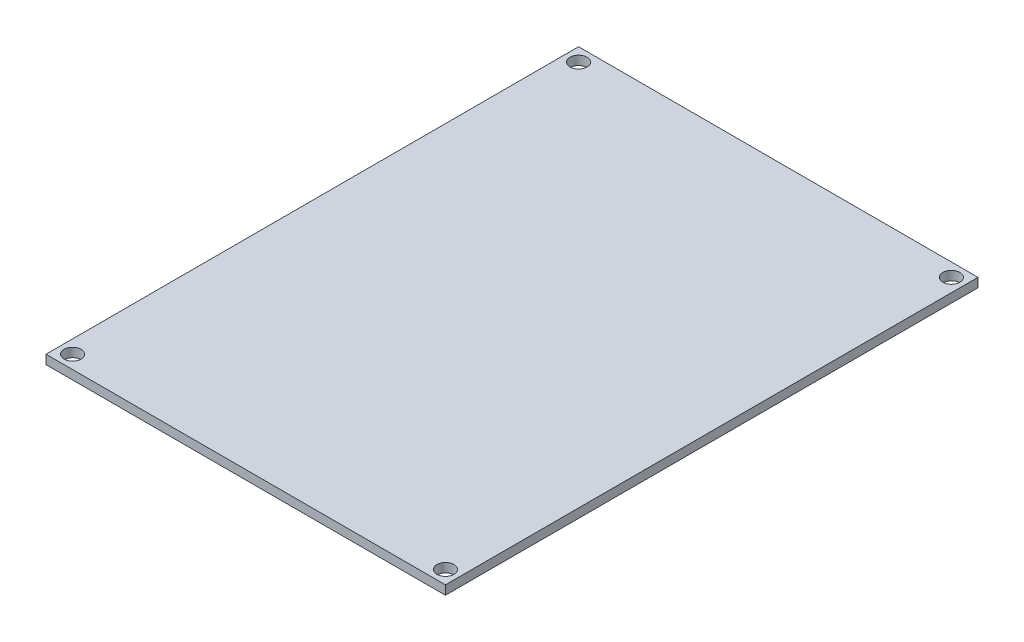
ISO-10303-21;
HEADER;
FILE_DESCRIPTION(('STEP AP214'),'2;1');
FILE_NAME('part.step','',(''),(''),'','','');
FILE_SCHEMA(('AUTOMOTIVE_DESIGN { 1 0 10303 214 1 1 1 1 }'));
ENDSEC;
DATA;
#1=APPLICATION_CONTEXT('core data for automotive mechanical design processes');
#2=APPLICATION_PROTOCOL_DEFINITION('international standard','automotive_design',2000,#1);
#3=PRODUCT_CONTEXT('',#1,'mechanical');
#4=PRODUCT('Part','Part','',(#3));
#5=PRODUCT_RELATED_PRODUCT_CATEGORY('part','',(#4));
#6=PRODUCT_DEFINITION_FORMATION('','',#4);
#7=PRODUCT_DEFINITION_CONTEXT('part definition',#1,'design');
#8=PRODUCT_DEFINITION('design','',#6,#7);
#9=PRODUCT_DEFINITION_SHAPE('','',#8);
#10=(LENGTH_UNIT() NAMED_UNIT(*) SI_UNIT(.MILLI.,.METRE.));
#11=(NAMED_UNIT(*) PLANE_ANGLE_UNIT() SI_UNIT($,.RADIAN.));
#12=(NAMED_UNIT(*) SI_UNIT($,.STERADIAN.) SOLID_ANGLE_UNIT());
#13=UNCERTAINTY_MEASURE_WITH_UNIT(LENGTH_MEASURE(1.E-05),#10,'distance_accuracy_value','');
#14=(GEOMETRIC_REPRESENTATION_CONTEXT(3) GLOBAL_UNCERTAINTY_ASSIGNED_CONTEXT((#13)) GLOBAL_UNIT_ASSIGNED_CONTEXT((#10,
#11,#12)) REPRESENTATION_CONTEXT('',''));
#15=CARTESIAN_POINT('',(0.,0.,0.));
#16=DIRECTION('',(0.,0.,1.));
#17=DIRECTION('',(1.,0.,0.));
#18=AXIS2_PLACEMENT_3D('',#15,#16,#17);
#19=CARTESIAN_POINT('',(0.,1.7,0.));
#20=DIRECTION('',(0.,-1.,0.));
#21=DIRECTION('',(0.,0.,-1.));
#22=AXIS2_PLACEMENT_3D('',#19,#20,#21);
#23=PLANE('',#22);
#24=CARTESIAN_POINT('',(-35.,1.7,47.5));
#25=DIRECTION('',(0.,1.,0.));
#26=DIRECTION('',(0.,0.,1.));
#27=AXIS2_PLACEMENT_3D('',#24,#25,#26);
#28=CIRCLE('',#27,1.6);
#29=CARTESIAN_POINT('',(-35.,1.7,49.1));
#30=VERTEX_POINT('',#29);
#31=EDGE_CURVE('E128',#30,#30,#28,.T.);
#32=ORIENTED_EDGE('',*,*,#31,.F.);
#33=EDGE_LOOP('',(#32));
#34=FACE_BOUND('',#33,.T.);
#35=CARTESIAN_POINT('',(-35.,1.7,-47.5));
#36=DIRECTION('',(0.,1.,0.));
#37=DIRECTION('',(0.,0.,1.));
#38=AXIS2_PLACEMENT_3D('',#35,#36,#37);
#39=CIRCLE('',#38,1.6);
#40=CARTESIAN_POINT('',(-35.,1.7,-45.9));
#41=VERTEX_POINT('',#40);
#42=EDGE_CURVE('E107',#41,#41,#39,.T.);
#43=ORIENTED_EDGE('',*,*,#42,.F.);
#44=EDGE_LOOP('',(#43));
#45=FACE_BOUND('',#44,.T.);
#46=DIRECTION('',(0.,0.,-1.));
#47=VECTOR('',#46,1.);
#48=CARTESIAN_POINT('',(37.5,1.7,50.));
#49=LINE('',#48,#47);
#50=CARTESIAN_POINT('',(37.5,1.7,50.));
#51=VERTEX_POINT('',#50);
#52=CARTESIAN_POINT('',(37.5,1.7,-50.));
#53=VERTEX_POINT('',#52);
#54=EDGE_CURVE('E92',#51,#53,#49,.T.);
#55=ORIENTED_EDGE('',*,*,#54,.T.);
#56=DIRECTION('',(-1.,0.,0.));
#57=VECTOR('',#56,1.);
#58=CARTESIAN_POINT('',(-37.5,1.7,-50.));
#59=LINE('',#58,#57);
#60=CARTESIAN_POINT('',(-37.5,1.7,-50.));
#61=VERTEX_POINT('',#60);
#62=EDGE_CURVE('E87',#53,#61,#59,.T.);
#63=ORIENTED_EDGE('',*,*,#62,.T.);
#64=DIRECTION('',(0.,0.,1.));
#65=VECTOR('',#64,1.);
#66=CARTESIAN_POINT('',(-37.5,1.7,50.));
#67=LINE('',#66,#65);
#68=CARTESIAN_POINT('',(-37.5,1.7,50.));
#69=VERTEX_POINT('',#68);
#70=EDGE_CURVE('E90',#61,#69,#67,.T.);
#71=ORIENTED_EDGE('',*,*,#70,.T.);
#72=DIRECTION('',(1.,0.,0.));
#73=VECTOR('',#72,1.);
#74=CARTESIAN_POINT('',(-37.5,1.7,50.));
#75=LINE('',#74,#73);
#76=EDGE_CURVE('E57',#69,#51,#75,.T.);
#77=ORIENTED_EDGE('',*,*,#76,.T.);
#78=EDGE_LOOP('',(#55,#63,#71,#77));
#79=FACE_BOUND('',#78,.T.);
#80=CARTESIAN_POINT('',(35.,1.7,47.5));
#81=DIRECTION('',(0.,1.,0.));
#82=DIRECTION('',(0.,0.,1.));
#83=AXIS2_PLACEMENT_3D('',#80,#81,#82);
#84=CIRCLE('',#83,1.59999999999999);
#85=CARTESIAN_POINT('',(35.,1.7,49.1));
#86=VERTEX_POINT('',#85);
#87=EDGE_CURVE('E139',#86,#86,#84,.F.);
#88=ORIENTED_EDGE('',*,*,#87,.T.);
#89=EDGE_LOOP('',(#88));
#90=FACE_BOUND('',#89,.T.);
#91=CARTESIAN_POINT('',(35.,1.7,-47.5));
#92=DIRECTION('',(0.,1.,0.));
#93=DIRECTION('',(0.,0.,1.));
#94=AXIS2_PLACEMENT_3D('',#91,#92,#93);
#95=CIRCLE('',#94,1.59999999999998);
#96=CARTESIAN_POINT('',(35.,1.7,-45.9));
#97=VERTEX_POINT('',#96);
#98=EDGE_CURVE('E132',#97,#97,#95,.F.);
#99=ORIENTED_EDGE('',*,*,#98,.T.);
#100=EDGE_LOOP('',(#99));
#101=FACE_BOUND('',#100,.T.);
#102=ADVANCED_FACE('F40',(#34,#45,#79,#90,#101),#23,.F.);
#103=CARTESIAN_POINT('',(0.,0.,0.));
#104=DIRECTION('',(0.,-1.,0.));
#105=DIRECTION('',(0.,0.,-1.));
#106=AXIS2_PLACEMENT_3D('',#103,#104,#105);
#107=PLANE('',#106);
#108=CARTESIAN_POINT('',(35.,0.,47.5));
#109=DIRECTION('',(0.,-1.,0.));
#110=DIRECTION('',(0.,0.,-1.));
#111=AXIS2_PLACEMENT_3D('',#108,#109,#110);
#112=CIRCLE('',#111,1.59999999999999);
#113=CARTESIAN_POINT('',(35.,0.,45.9));
#114=VERTEX_POINT('',#113);
#115=EDGE_CURVE('E129',#114,#114,#112,.T.);
#116=ORIENTED_EDGE('',*,*,#115,.F.);
#117=EDGE_LOOP('',(#116));
#118=FACE_BOUND('',#117,.T.);
#119=CARTESIAN_POINT('',(-35.,0.,-47.5));
#120=DIRECTION('',(0.,-1.,0.));
#121=DIRECTION('',(0.,0.,-1.));
#122=AXIS2_PLACEMENT_3D('',#119,#120,#121);
#123=CIRCLE('',#122,1.6);
#124=CARTESIAN_POINT('',(-35.,0.,-49.1));
#125=VERTEX_POINT('',#124);
#126=EDGE_CURVE('E119',#125,#125,#123,.F.);
#127=ORIENTED_EDGE('',*,*,#126,.T.);
#128=EDGE_LOOP('',(#127));
#129=FACE_BOUND('',#128,.T.);
#130=DIRECTION('',(0.,0.,-1.));
#131=VECTOR('',#130,1.);
#132=CARTESIAN_POINT('',(37.5,0.,50.));
#133=LINE('',#132,#131);
#134=CARTESIAN_POINT('',(37.5,0.,50.));
#135=VERTEX_POINT('',#134);
#136=CARTESIAN_POINT('',(37.5,0.,-50.));
#137=VERTEX_POINT('',#136);
#138=EDGE_CURVE('E104',#135,#137,#133,.T.);
#139=ORIENTED_EDGE('',*,*,#138,.F.);
#140=DIRECTION('',(1.,0.,0.));
#141=VECTOR('',#140,1.);
#142=CARTESIAN_POINT('',(-37.5,0.,50.));
#143=LINE('',#142,#141);
#144=CARTESIAN_POINT('',(-37.5,0.,50.));
#145=VERTEX_POINT('',#144);
#146=EDGE_CURVE('E80',#145,#135,#143,.T.);
#147=ORIENTED_EDGE('',*,*,#146,.F.);
#148=DIRECTION('',(0.,0.,1.));
#149=VECTOR('',#148,1.);
#150=CARTESIAN_POINT('',(-37.5,0.,50.));
#151=LINE('',#150,#149);
#152=CARTESIAN_POINT('',(-37.5,0.,-50.));
#153=VERTEX_POINT('',#152);
#154=EDGE_CURVE('E74',#153,#145,#151,.T.);
#155=ORIENTED_EDGE('',*,*,#154,.F.);
#156=DIRECTION('',(-1.,0.,0.));
#157=VECTOR('',#156,1.);
#158=CARTESIAN_POINT('',(-37.5,0.,-50.));
#159=LINE('',#158,#157);
#160=EDGE_CURVE('E96',#137,#153,#159,.T.);
#161=ORIENTED_EDGE('',*,*,#160,.F.);
#162=EDGE_LOOP('',(#139,#147,#155,#161));
#163=FACE_BOUND('',#162,.T.);
#164=CARTESIAN_POINT('',(-35.,0.,47.5));
#165=DIRECTION('',(0.,-1.,0.));
#166=DIRECTION('',(0.,0.,-1.));
#167=AXIS2_PLACEMENT_3D('',#164,#165,#166);
#168=CIRCLE('',#167,1.6);
#169=CARTESIAN_POINT('',(-35.,0.,45.9));
#170=VERTEX_POINT('',#169);
#171=EDGE_CURVE('E125',#170,#170,#168,.F.);
#172=ORIENTED_EDGE('',*,*,#171,.T.);
#173=EDGE_LOOP('',(#172));
#174=FACE_BOUND('',#173,.T.);
#175=CARTESIAN_POINT('',(35.,0.,-47.5));
#176=DIRECTION('',(0.,-1.,0.));
#177=DIRECTION('',(0.,0.,-1.));
#178=AXIS2_PLACEMENT_3D('',#175,#176,#177);
#179=CIRCLE('',#178,1.59999999999998);
#180=CARTESIAN_POINT('',(35.,0.,-49.1));
#181=VERTEX_POINT('',#180);
#182=EDGE_CURVE('E122',#181,#181,#179,.T.);
#183=ORIENTED_EDGE('',*,*,#182,.F.);
#184=EDGE_LOOP('',(#183));
#185=FACE_BOUND('',#184,.T.);
#186=ADVANCED_FACE('F115',(#118,#129,#163,#174,#185),#107,.T.);
#187=CARTESIAN_POINT('',(37.5,1.7,50.));
#188=DIRECTION('',(-1.,0.,0.));
#189=DIRECTION('',(0.,0.,1.));
#190=AXIS2_PLACEMENT_3D('',#187,#188,#189);
#191=PLANE('',#190);
#192=ORIENTED_EDGE('',*,*,#138,.T.);
#193=DIRECTION('',(0.,-1.,0.));
#194=VECTOR('',#193,1.);
#195=CARTESIAN_POINT('',(37.5,1.7,-50.));
#196=LINE('',#195,#194);
#197=EDGE_CURVE('E11',#53,#137,#196,.T.);
#198=ORIENTED_EDGE('',*,*,#197,.F.);
#199=ORIENTED_EDGE('',*,*,#54,.F.);
#200=DIRECTION('',(0.,-1.,0.));
#201=VECTOR('',#200,1.);
#202=CARTESIAN_POINT('',(37.5,1.7,50.));
#203=LINE('',#202,#201);
#204=EDGE_CURVE('E100',#51,#135,#203,.T.);
#205=ORIENTED_EDGE('',*,*,#204,.T.);
#206=EDGE_LOOP('',(#192,#198,#199,#205));
#207=FACE_BOUND('',#206,.T.);
#208=ADVANCED_FACE('F42',(#207),#191,.F.);
#209=CARTESIAN_POINT('',(-37.5,1.7,-50.));
#210=DIRECTION('',(0.,0.,1.));
#211=DIRECTION('',(1.,0.,0.));
#212=AXIS2_PLACEMENT_3D('',#209,#210,#211);
#213=PLANE('',#212);
#214=ORIENTED_EDGE('',*,*,#160,.T.);
#215=DIRECTION('',(0.,-1.,0.));
#216=VECTOR('',#215,1.);
#217=CARTESIAN_POINT('',(-37.5,1.7,-50.));
#218=LINE('',#217,#216);
#219=EDGE_CURVE('E49',#61,#153,#218,.T.);
#220=ORIENTED_EDGE('',*,*,#219,.F.);
#221=ORIENTED_EDGE('',*,*,#62,.F.);
#222=ORIENTED_EDGE('',*,*,#197,.T.);
#223=EDGE_LOOP('',(#214,#220,#221,#222));
#224=FACE_BOUND('',#223,.T.);
#225=ADVANCED_FACE('F95',(#224),#213,.F.);
#226=CARTESIAN_POINT('',(-37.5,1.7,50.));
#227=DIRECTION('',(1.,0.,0.));
#228=DIRECTION('',(0.,0.,-1.));
#229=AXIS2_PLACEMENT_3D('',#226,#227,#228);
#230=PLANE('',#229);
#231=ORIENTED_EDGE('',*,*,#154,.T.);
#232=DIRECTION('',(0.,-1.,0.));
#233=VECTOR('',#232,1.);
#234=CARTESIAN_POINT('',(-37.5,1.7,50.));
#235=LINE('',#234,#233);
#236=EDGE_CURVE('E97',#69,#145,#235,.T.);
#237=ORIENTED_EDGE('',*,*,#236,.F.);
#238=ORIENTED_EDGE('',*,*,#70,.F.);
#239=ORIENTED_EDGE('',*,*,#219,.T.);
#240=EDGE_LOOP('',(#231,#237,#238,#239));
#241=FACE_BOUND('',#240,.T.);
#242=ADVANCED_FACE('F98',(#241),#230,.F.);
#243=CARTESIAN_POINT('',(-37.5,1.7,50.));
#244=DIRECTION('',(0.,0.,-1.));
#245=DIRECTION('',(-1.,0.,0.));
#246=AXIS2_PLACEMENT_3D('',#243,#244,#245);
#247=PLANE('',#246);
#248=ORIENTED_EDGE('',*,*,#146,.T.);
#249=ORIENTED_EDGE('',*,*,#204,.F.);
#250=ORIENTED_EDGE('',*,*,#76,.F.);
#251=ORIENTED_EDGE('',*,*,#236,.T.);
#252=EDGE_LOOP('',(#248,#249,#250,#251));
#253=FACE_BOUND('',#252,.T.);
#254=ADVANCED_FACE('F112',(#253),#247,.F.);
#255=CARTESIAN_POINT('',(-35.,-0.000999999999999916,-47.5));
#256=DIRECTION('',(0.,1.,0.));
#257=DIRECTION('',(0.,0.,1.));
#258=AXIS2_PLACEMENT_3D('',#255,#256,#257);
#259=CYLINDRICAL_SURFACE('',#258,1.6);
#260=ORIENTED_EDGE('',*,*,#126,.F.);
#261=EDGE_LOOP('',(#260));
#262=FACE_BOUND('',#261,.T.);
#263=ORIENTED_EDGE('',*,*,#42,.T.);
#264=EDGE_LOOP('',(#263));
#265=FACE_BOUND('',#264,.T.);
#266=ADVANCED_FACE('F147',(#262,#265),#259,.F.);
#267=CARTESIAN_POINT('',(35.,-0.000999999999999916,47.5));
#268=DIRECTION('',(0.,1.,0.));
#269=DIRECTION('',(0.,0.,1.));
#270=AXIS2_PLACEMENT_3D('',#267,#268,#269);
#271=CYLINDRICAL_SURFACE('',#270,1.59999999999999);
#272=ORIENTED_EDGE('',*,*,#115,.T.);
#273=EDGE_LOOP('',(#272));
#274=FACE_BOUND('',#273,.T.);
#275=ORIENTED_EDGE('',*,*,#87,.F.);
#276=EDGE_LOOP('',(#275));
#277=FACE_BOUND('',#276,.T.);
#278=ADVANCED_FACE('F144',(#274,#277),#271,.F.);
#279=CARTESIAN_POINT('',(-35.,-0.000999999999999916,47.5));
#280=DIRECTION('',(0.,1.,0.));
#281=DIRECTION('',(0.,0.,1.));
#282=AXIS2_PLACEMENT_3D('',#279,#280,#281);
#283=CYLINDRICAL_SURFACE('',#282,1.6);
#284=ORIENTED_EDGE('',*,*,#171,.F.);
#285=EDGE_LOOP('',(#284));
#286=FACE_BOUND('',#285,.T.);
#287=ORIENTED_EDGE('',*,*,#31,.T.);
#288=EDGE_LOOP('',(#287));
#289=FACE_BOUND('',#288,.T.);
#290=ADVANCED_FACE('F146',(#286,#289),#283,.F.);
#291=CARTESIAN_POINT('',(35.,-0.000999999999999916,-47.5));
#292=DIRECTION('',(0.,1.,0.));
#293=DIRECTION('',(0.,0.,1.));
#294=AXIS2_PLACEMENT_3D('',#291,#292,#293);
#295=CYLINDRICAL_SURFACE('',#294,1.59999999999998);
#296=ORIENTED_EDGE('',*,*,#182,.T.);
#297=EDGE_LOOP('',(#296));
#298=FACE_BOUND('',#297,.T.);
#299=ORIENTED_EDGE('',*,*,#98,.F.);
#300=EDGE_LOOP('',(#299));
#301=FACE_BOUND('',#300,.T.);
#302=ADVANCED_FACE('F154',(#298,#301),#295,.F.);
#303=CLOSED_SHELL('',(#102,#186,#208,#225,#242,#254,#266,#278,#290,#302));
#304=MANIFOLD_SOLID_BREP('B2',#303);
#305=ADVANCED_BREP_SHAPE_REPRESENTATION('',(#18,#304),#14);
#306=SHAPE_DEFINITION_REPRESENTATION(#9,#305);
ENDSEC;
END-ISO-10303-21;
